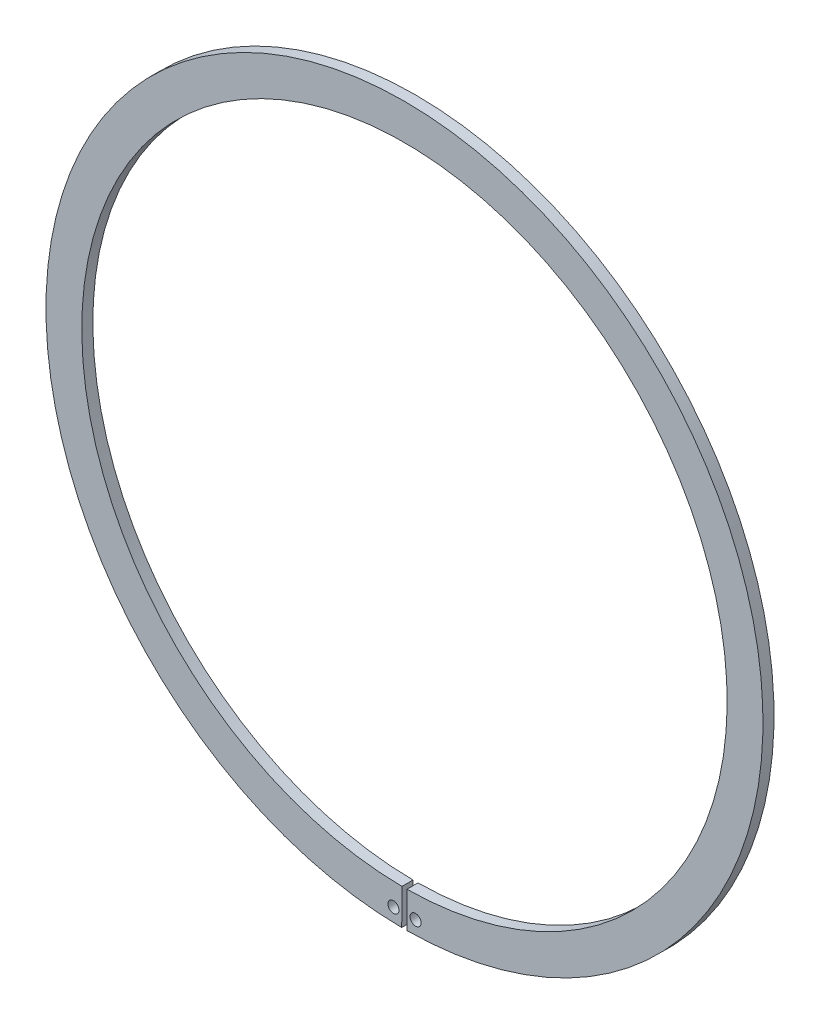
ISO-10303-21;
HEADER;
FILE_DESCRIPTION(('STEP AP214'),'2;1');
FILE_NAME('part.step','',(''),(''),'','','');
FILE_SCHEMA(('AUTOMOTIVE_DESIGN { 1 0 10303 214 1 1 1 1 }'));
ENDSEC;
DATA;
#1=APPLICATION_CONTEXT('core data for automotive mechanical design processes');
#2=APPLICATION_PROTOCOL_DEFINITION('international standard','automotive_design',2000,#1);
#3=PRODUCT_CONTEXT('',#1,'mechanical');
#4=PRODUCT('Part','Part','',(#3));
#5=PRODUCT_RELATED_PRODUCT_CATEGORY('part','',(#4));
#6=PRODUCT_DEFINITION_FORMATION('','',#4);
#7=PRODUCT_DEFINITION_CONTEXT('part definition',#1,'design');
#8=PRODUCT_DEFINITION('design','',#6,#7);
#9=PRODUCT_DEFINITION_SHAPE('','',#8);
#10=(LENGTH_UNIT() NAMED_UNIT(*) SI_UNIT(.MILLI.,.METRE.));
#11=(NAMED_UNIT(*) PLANE_ANGLE_UNIT() SI_UNIT($,.RADIAN.));
#12=(NAMED_UNIT(*) SI_UNIT($,.STERADIAN.) SOLID_ANGLE_UNIT());
#13=UNCERTAINTY_MEASURE_WITH_UNIT(LENGTH_MEASURE(1.E-05),#10,'distance_accuracy_value','');
#14=(GEOMETRIC_REPRESENTATION_CONTEXT(3) GLOBAL_UNCERTAINTY_ASSIGNED_CONTEXT((#13)) GLOBAL_UNIT_ASSIGNED_CONTEXT((#10,
#11,#12)) REPRESENTATION_CONTEXT('',''));
#15=CARTESIAN_POINT('',(0.,0.,0.));
#16=DIRECTION('',(0.,0.,1.));
#17=DIRECTION('',(1.,0.,0.));
#18=AXIS2_PLACEMENT_3D('',#15,#16,#17);
#19=CARTESIAN_POINT('',(0.,0.,-5.));
#20=DIRECTION('',(0.,0.,1.));
#21=DIRECTION('',(1.,0.,0.));
#22=AXIS2_PLACEMENT_3D('',#19,#20,#21);
#23=CYLINDRICAL_SURFACE('',#22,146.);
#24=CARTESIAN_POINT('',(0.,0.,-5.));
#25=DIRECTION('',(0.,0.,-1.));
#26=DIRECTION('',(1.,0.,0.));
#27=AXIS2_PLACEMENT_3D('',#24,#25,#26);
#28=CIRCLE('',#27,146.);
#29=CARTESIAN_POINT('',(-1.12515413070284,-145.995664415702,-5.));
#30=VERTEX_POINT('',#29);
#31=CARTESIAN_POINT('',(1.12515413070284,-145.995664415702,-5.));
#32=VERTEX_POINT('',#31);
#33=EDGE_CURVE('E77',#30,#32,#28,.T.);
#34=ORIENTED_EDGE('',*,*,#33,.T.);
#35=DIRECTION('',(0.,0.,1.));
#36=VECTOR('',#35,1.);
#37=CARTESIAN_POINT('',(1.12515413070284,-145.995664415702,-5.));
#38=LINE('',#37,#36);
#39=CARTESIAN_POINT('',(1.12515413070284,-145.995664415702,0.));
#40=VERTEX_POINT('',#39);
#41=EDGE_CURVE('E39',#32,#40,#38,.T.);
#42=ORIENTED_EDGE('',*,*,#41,.T.);
#43=CARTESIAN_POINT('',(0.,0.,0.));
#44=DIRECTION('',(0.,0.,-1.));
#45=DIRECTION('',(1.,0.,0.));
#46=AXIS2_PLACEMENT_3D('',#43,#44,#45);
#47=CIRCLE('',#46,146.);
#48=CARTESIAN_POINT('',(-1.12515413070284,-145.995664415702,0.));
#49=VERTEX_POINT('',#48);
#50=EDGE_CURVE('E105',#49,#40,#47,.T.);
#51=ORIENTED_EDGE('',*,*,#50,.F.);
#52=DIRECTION('',(0.,0.,1.));
#53=VECTOR('',#52,1.);
#54=CARTESIAN_POINT('',(-1.12515413070284,-145.995664415702,-5.));
#55=LINE('',#54,#53);
#56=EDGE_CURVE('E11',#30,#49,#55,.T.);
#57=ORIENTED_EDGE('',*,*,#56,.F.);
#58=EDGE_LOOP('',(#34,#42,#51,#57));
#59=FACE_BOUND('',#58,.T.);
#60=ADVANCED_FACE('F36',(#59),#23,.F.);
#61=CARTESIAN_POINT('',(-1.12515413070284,-145.995664415702,-5.));
#62=DIRECTION('',(0.999970304217134,-0.00770653514180024,0.));
#63=DIRECTION('',(0.00770653514180024,0.999970304217135,0.));
#64=AXIS2_PLACEMENT_3D('',#61,#62,#63);
#65=PLANE('',#64);
#66=DIRECTION('',(0.00770653514180024,0.999970304217134,0.));
#67=VECTOR('',#66,1.);
#68=CARTESIAN_POINT('',(-1.12515413070284,-145.995664415702,0.));
#69=LINE('',#68,#67);
#70=CARTESIAN_POINT('',(-1.25,-162.195183344019,0.));
#71=VERTEX_POINT('',#70);
#72=EDGE_CURVE('E100',#71,#49,#69,.T.);
#73=ORIENTED_EDGE('',*,*,#72,.F.);
#74=DIRECTION('',(0.,0.,1.));
#75=VECTOR('',#74,1.);
#76=CARTESIAN_POINT('',(-1.25,-162.195183344019,-5.));
#77=LINE('',#76,#75);
#78=CARTESIAN_POINT('',(-1.25,-162.195183344019,-5.));
#79=VERTEX_POINT('',#78);
#80=EDGE_CURVE('E45',#79,#71,#77,.T.);
#81=ORIENTED_EDGE('',*,*,#80,.F.);
#82=DIRECTION('',(0.00770653514180024,0.999970304217134,0.));
#83=VECTOR('',#82,1.);
#84=CARTESIAN_POINT('',(-1.12515413070284,-145.995664415702,-5.));
#85=LINE('',#84,#83);
#86=EDGE_CURVE('E96',#79,#30,#85,.T.);
#87=ORIENTED_EDGE('',*,*,#86,.T.);
#88=ORIENTED_EDGE('',*,*,#56,.T.);
#89=EDGE_LOOP('',(#73,#81,#87,#88));
#90=FACE_BOUND('',#89,.T.);
#91=ADVANCED_FACE('F112',(#90),#65,.T.);
#92=CARTESIAN_POINT('',(0.,0.,-5.));
#93=DIRECTION('',(0.,0.,1.));
#94=DIRECTION('',(1.,0.,0.));
#95=AXIS2_PLACEMENT_3D('',#92,#93,#94);
#96=CYLINDRICAL_SURFACE('',#95,162.2);
#97=ORIENTED_EDGE('',*,*,#80,.T.);
#98=CARTESIAN_POINT('',(0.,0.,0.));
#99=DIRECTION('',(0.,0.,1.));
#100=DIRECTION('',(1.,0.,0.));
#101=AXIS2_PLACEMENT_3D('',#98,#99,#100);
#102=CIRCLE('',#101,162.2);
#103=CARTESIAN_POINT('',(1.25000000000001,-162.195183344019,0.));
#104=VERTEX_POINT('',#103);
#105=EDGE_CURVE('E69',#104,#71,#102,.T.);
#106=ORIENTED_EDGE('',*,*,#105,.F.);
#107=DIRECTION('',(0.,0.,1.));
#108=VECTOR('',#107,1.);
#109=CARTESIAN_POINT('',(1.25000000000001,-162.195183344019,-5.));
#110=LINE('',#109,#108);
#111=CARTESIAN_POINT('',(1.25000000000001,-162.195183344019,-5.));
#112=VERTEX_POINT('',#111);
#113=EDGE_CURVE('E82',#112,#104,#110,.T.);
#114=ORIENTED_EDGE('',*,*,#113,.F.);
#115=CARTESIAN_POINT('',(0.,0.,-5.));
#116=DIRECTION('',(0.,0.,1.));
#117=DIRECTION('',(1.,0.,0.));
#118=AXIS2_PLACEMENT_3D('',#115,#116,#117);
#119=CIRCLE('',#118,162.2);
#120=EDGE_CURVE('E85',#112,#79,#119,.T.);
#121=ORIENTED_EDGE('',*,*,#120,.T.);
#122=EDGE_LOOP('',(#97,#106,#114,#121));
#123=FACE_BOUND('',#122,.T.);
#124=ADVANCED_FACE('F84',(#123),#96,.T.);
#125=CARTESIAN_POINT('',(1.12515413070284,-145.995664415702,-5.));
#126=DIRECTION('',(-0.999970304217134,-0.00770653514180024,0.));
#127=DIRECTION('',(0.00770653514180024,-0.999970304217135,0.));
#128=AXIS2_PLACEMENT_3D('',#125,#126,#127);
#129=PLANE('',#128);
#130=DIRECTION('',(0.00770653514180024,-0.999970304217134,0.));
#131=VECTOR('',#130,1.);
#132=CARTESIAN_POINT('',(1.12515413070284,-145.995664415702,0.));
#133=LINE('',#132,#131);
#134=EDGE_CURVE('E107',#40,#104,#133,.T.);
#135=ORIENTED_EDGE('',*,*,#134,.F.);
#136=ORIENTED_EDGE('',*,*,#41,.F.);
#137=DIRECTION('',(0.00770653514180024,-0.999970304217134,0.));
#138=VECTOR('',#137,1.);
#139=CARTESIAN_POINT('',(1.12515413070284,-145.995664415702,-5.));
#140=LINE('',#139,#138);
#141=EDGE_CURVE('E95',#32,#112,#140,.T.);
#142=ORIENTED_EDGE('',*,*,#141,.T.);
#143=ORIENTED_EDGE('',*,*,#113,.T.);
#144=EDGE_LOOP('',(#135,#136,#142,#143));
#145=FACE_BOUND('',#144,.T.);
#146=ADVANCED_FACE('F98',(#145),#129,.T.);
#147=CARTESIAN_POINT('',(0.,0.,-5.));
#148=DIRECTION('',(0.,0.,1.));
#149=DIRECTION('',(1.,0.,0.));
#150=AXIS2_PLACEMENT_3D('',#147,#148,#149);
#151=PLANE('',#150);
#152=ORIENTED_EDGE('',*,*,#86,.F.);
#153=ORIENTED_EDGE('',*,*,#120,.F.);
#154=ORIENTED_EDGE('',*,*,#141,.F.);
#155=ORIENTED_EDGE('',*,*,#33,.F.);
#156=EDGE_LOOP('',(#152,#153,#154,#155));
#157=FACE_BOUND('',#156,.T.);
#158=CARTESIAN_POINT('',(5.,-156.019902576562,-5.));
#159=DIRECTION('',(0.,0.,1.));
#160=DIRECTION('',(1.,0.,0.));
#161=AXIS2_PLACEMENT_3D('',#158,#159,#160);
#162=CIRCLE('',#161,2.5);
#163=CARTESIAN_POINT('',(7.5,-156.019902576562,-5.));
#164=VERTEX_POINT('',#163);
#165=EDGE_CURVE('E108',#164,#164,#162,.T.);
#166=ORIENTED_EDGE('',*,*,#165,.T.);
#167=EDGE_LOOP('',(#166));
#168=FACE_BOUND('',#167,.T.);
#169=CARTESIAN_POINT('',(-5.,-156.019902576562,-5.));
#170=DIRECTION('',(0.,0.,1.));
#171=DIRECTION('',(1.,0.,0.));
#172=AXIS2_PLACEMENT_3D('',#169,#170,#171);
#173=CIRCLE('',#172,2.5);
#174=CARTESIAN_POINT('',(-2.5,-156.019902576562,-5.));
#175=VERTEX_POINT('',#174);
#176=EDGE_CURVE('E146',#175,#175,#173,.T.);
#177=ORIENTED_EDGE('',*,*,#176,.T.);
#178=EDGE_LOOP('',(#177));
#179=FACE_BOUND('',#178,.T.);
#180=ADVANCED_FACE('F93',(#157,#168,#179),#151,.F.);
#181=CARTESIAN_POINT('',(0.,0.,0.));
#182=DIRECTION('',(0.,0.,1.));
#183=DIRECTION('',(1.,0.,0.));
#184=AXIS2_PLACEMENT_3D('',#181,#182,#183);
#185=PLANE('',#184);
#186=ORIENTED_EDGE('',*,*,#134,.T.);
#187=ORIENTED_EDGE('',*,*,#105,.T.);
#188=ORIENTED_EDGE('',*,*,#72,.T.);
#189=ORIENTED_EDGE('',*,*,#50,.T.);
#190=EDGE_LOOP('',(#186,#187,#188,#189));
#191=FACE_BOUND('',#190,.T.);
#192=CARTESIAN_POINT('',(5.,-156.019902576562,0.));
#193=DIRECTION('',(0.,0.,1.));
#194=DIRECTION('',(1.,0.,0.));
#195=AXIS2_PLACEMENT_3D('',#192,#193,#194);
#196=CIRCLE('',#195,2.5);
#197=CARTESIAN_POINT('',(7.5,-156.019902576562,0.));
#198=VERTEX_POINT('',#197);
#199=EDGE_CURVE('E152',#198,#198,#196,.T.);
#200=ORIENTED_EDGE('',*,*,#199,.F.);
#201=EDGE_LOOP('',(#200));
#202=FACE_BOUND('',#201,.T.);
#203=CARTESIAN_POINT('',(-5.,-156.019902576562,0.));
#204=DIRECTION('',(0.,0.,1.));
#205=DIRECTION('',(1.,0.,0.));
#206=AXIS2_PLACEMENT_3D('',#203,#204,#205);
#207=CIRCLE('',#206,2.5);
#208=CARTESIAN_POINT('',(-2.5,-156.019902576562,0.));
#209=VERTEX_POINT('',#208);
#210=EDGE_CURVE('E149',#209,#209,#207,.T.);
#211=ORIENTED_EDGE('',*,*,#210,.F.);
#212=EDGE_LOOP('',(#211));
#213=FACE_BOUND('',#212,.T.);
#214=ADVANCED_FACE('F113',(#191,#202,#213),#185,.T.);
#215=CARTESIAN_POINT('',(5.,-156.019902576562,-5.));
#216=DIRECTION('',(0.,0.,1.));
#217=DIRECTION('',(1.,0.,0.));
#218=AXIS2_PLACEMENT_3D('',#215,#216,#217);
#219=CYLINDRICAL_SURFACE('',#218,2.5);
#220=ORIENTED_EDGE('',*,*,#165,.F.);
#221=EDGE_LOOP('',(#220));
#222=FACE_BOUND('',#221,.T.);
#223=ORIENTED_EDGE('',*,*,#199,.T.);
#224=EDGE_LOOP('',(#223));
#225=FACE_BOUND('',#224,.T.);
#226=ADVANCED_FACE('F133',(#222,#225),#219,.F.);
#227=CARTESIAN_POINT('',(-5.,-156.019902576562,-5.));
#228=DIRECTION('',(0.,0.,1.));
#229=DIRECTION('',(1.,0.,0.));
#230=AXIS2_PLACEMENT_3D('',#227,#228,#229);
#231=CYLINDRICAL_SURFACE('',#230,2.5);
#232=ORIENTED_EDGE('',*,*,#176,.F.);
#233=EDGE_LOOP('',(#232));
#234=FACE_BOUND('',#233,.T.);
#235=ORIENTED_EDGE('',*,*,#210,.T.);
#236=EDGE_LOOP('',(#235));
#237=FACE_BOUND('',#236,.T.);
#238=ADVANCED_FACE('F137',(#234,#237),#231,.F.);
#239=CLOSED_SHELL('',(#60,#91,#124,#146,#180,#214,#226,#238));
#240=MANIFOLD_SOLID_BREP('B2',#239);
#241=ADVANCED_BREP_SHAPE_REPRESENTATION('',(#18,#240),#14);
#242=SHAPE_DEFINITION_REPRESENTATION(#9,#241);
ENDSEC;
END-ISO-10303-21;
